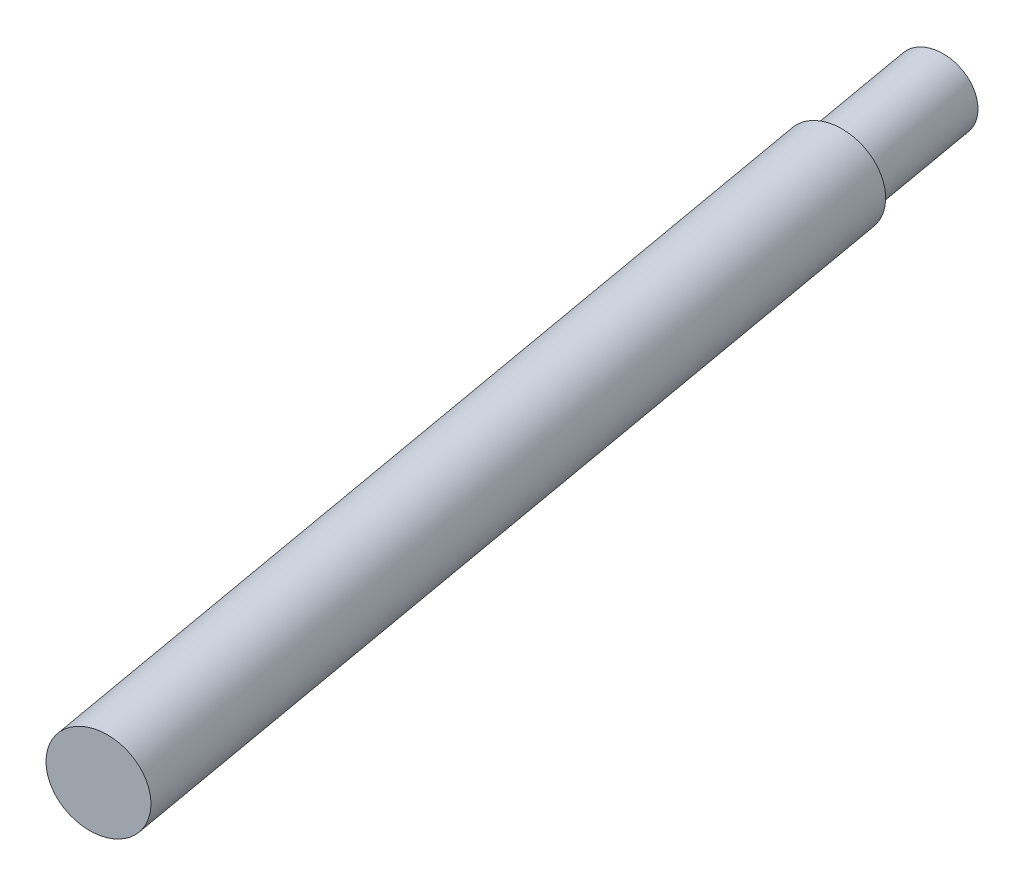
ISO-10303-21;
HEADER;
FILE_DESCRIPTION(('STEP AP214'),'2;1');
FILE_NAME('part.step','',(''),(''),'','','');
FILE_SCHEMA(('AUTOMOTIVE_DESIGN { 1 0 10303 214 1 1 1 1 }'));
ENDSEC;
DATA;
#1=APPLICATION_CONTEXT('core data for automotive mechanical design processes');
#2=APPLICATION_PROTOCOL_DEFINITION('international standard','automotive_design',2000,#1);
#3=PRODUCT_CONTEXT('',#1,'mechanical');
#4=PRODUCT('Part','Part','',(#3));
#5=PRODUCT_RELATED_PRODUCT_CATEGORY('part','',(#4));
#6=PRODUCT_DEFINITION_FORMATION('','',#4);
#7=PRODUCT_DEFINITION_CONTEXT('part definition',#1,'design');
#8=PRODUCT_DEFINITION('design','',#6,#7);
#9=PRODUCT_DEFINITION_SHAPE('','',#8);
#10=(LENGTH_UNIT() NAMED_UNIT(*) SI_UNIT(.MILLI.,.METRE.));
#11=(NAMED_UNIT(*) PLANE_ANGLE_UNIT() SI_UNIT($,.RADIAN.));
#12=(NAMED_UNIT(*) SI_UNIT($,.STERADIAN.) SOLID_ANGLE_UNIT());
#13=UNCERTAINTY_MEASURE_WITH_UNIT(LENGTH_MEASURE(1.E-05),#10,'distance_accuracy_value','');
#14=(GEOMETRIC_REPRESENTATION_CONTEXT(3) GLOBAL_UNCERTAINTY_ASSIGNED_CONTEXT((#13)) GLOBAL_UNIT_ASSIGNED_CONTEXT((#10,
#11,#12)) REPRESENTATION_CONTEXT('',''));
#15=CARTESIAN_POINT('',(0.,0.,0.));
#16=DIRECTION('',(0.,0.,1.));
#17=DIRECTION('',(1.,0.,0.));
#18=AXIS2_PLACEMENT_3D('',#15,#16,#17);
#19=CARTESIAN_POINT('',(11.67225708508,118.9917103573,7.637451840213));
#20=DIRECTION('',(0.17364817766695,0.,0.984807753012204));
#21=DIRECTION('',(-0.0479137499271273,0.998815746590787,0.00844848685917072));
#22=AXIS2_PLACEMENT_3D('',#19,#20,#21);
#23=PLANE('',#22);
#24=CARTESIAN_POINT('',(6.30818153894857,123.9325577555,8.58328308554958));
#25=DIRECTION('',(-0.173648177670289,0.,-0.984807753011616));
#26=DIRECTION('',(-0.984807753011616,0.,0.173648177670289));
#27=AXIS2_PLACEMENT_3D('',#24,#25,#26);
#28=CIRCLE('',#27,5.00000000005461);
#29=CARTESIAN_POINT('',(1.38414277383671,123.9325577555,9.45152397391051));
#30=VERTEX_POINT('',#29);
#31=EDGE_CURVE('E19',#30,#30,#28,.F.);
#32=ORIENTED_EDGE('',*,*,#31,.T.);
#33=EDGE_LOOP('',(#32));
#34=FACE_BOUND('',#33,.T.);
#35=ADVANCED_FACE('F15',(#34),#23,.T.);
#36=CARTESIAN_POINT('',(-17.38842302427,119.5746883034,-102.9969999337));
#37=DIRECTION('',(-0.173648177674628,-8.300870407707E-12,-0.984807753010851));
#38=DIRECTION('',(-0.0479137499263157,0.998815746590896,0.00844848685089488));
#39=AXIS2_PLACEMENT_3D('',#36,#37,#38);
#40=PLANE('',#39);
#41=CARTESIAN_POINT('',(-13.4877107153062,123.9325577555,-103.684800757812));
#42=DIRECTION('',(0.173648177658873,0.,0.984807753013629));
#43=DIRECTION('',(0.984807753013629,0.,-0.173648177658873));
#44=AXIS2_PLACEMENT_3D('',#41,#42,#43);
#45=CIRCLE('',#44,4.00000000003963);
#46=CARTESIAN_POINT('',(-9.54847970321262,123.9325577555,-104.379393468454));
#47=VERTEX_POINT('',#46);
#48=EDGE_CURVE('E28',#47,#47,#45,.F.);
#49=ORIENTED_EDGE('',*,*,#48,.T.);
#50=EDGE_LOOP('',(#49));
#51=FACE_BOUND('',#50,.T.);
#52=ADVANCED_FACE('F40',(#51),#40,.T.);
#53=CARTESIAN_POINT('',(6.30818153894858,123.9325577555,8.58328308554964));
#54=DIRECTION('',(-0.173648177670289,0.,-0.984807753011616));
#55=DIRECTION('',(-0.984807753011616,0.,0.173648177670289));
#56=AXIS2_PLACEMENT_3D('',#53,#54,#55);
#57=CYLINDRICAL_SURFACE('',#56,5.00000000005461);
#58=CARTESIAN_POINT('',(-11.0566362280798,123.9325577555,-89.8974922156088));
#59=DIRECTION('',(-0.173648177670289,0.,-0.984807753011616));
#60=DIRECTION('',(-0.984807753011616,0.,0.173648177670289));
#61=AXIS2_PLACEMENT_3D('',#58,#59,#60);
#62=CIRCLE('',#61,5.00000000005461);
#63=CARTESIAN_POINT('',(-15.9806749931916,123.9325577555,-89.0292513272478));
#64=VERTEX_POINT('',#63);
#65=EDGE_CURVE('E23',#64,#64,#62,.F.);
#66=ORIENTED_EDGE('',*,*,#65,.T.);
#67=EDGE_LOOP('',(#66));
#68=FACE_BOUND('',#67,.T.);
#69=ORIENTED_EDGE('',*,*,#31,.F.);
#70=EDGE_LOOP('',(#69));
#71=FACE_BOUND('',#70,.T.);
#72=ADVANCED_FACE('F37',(#68,#71),#57,.T.);
#73=CARTESIAN_POINT('',(-13.4877107153062,123.9325577555,-103.684800757812));
#74=DIRECTION('',(0.173648177658873,0.,0.984807753013629));
#75=DIRECTION('',(0.984807753013629,0.,-0.173648177658873));
#76=AXIS2_PLACEMENT_3D('',#73,#74,#75);
#77=CYLINDRICAL_SURFACE('',#76,4.00000000003963);
#78=CARTESIAN_POINT('',(-11.0566362280797,123.9325577555,-89.8974922156086));
#79=DIRECTION('',(0.173648177658873,0.,0.984807753013629));
#80=DIRECTION('',(0.984807753013629,0.,-0.173648177658873));
#81=AXIS2_PLACEMENT_3D('',#78,#79,#80);
#82=CIRCLE('',#81,4.00000000003963);
#83=CARTESIAN_POINT('',(-7.11740521598619,123.9325577555,-90.5920849262509));
#84=VERTEX_POINT('',#83);
#85=EDGE_CURVE('E10',#84,#84,#82,.F.);
#86=ORIENTED_EDGE('',*,*,#85,.T.);
#87=EDGE_LOOP('',(#86));
#88=FACE_BOUND('',#87,.T.);
#89=ORIENTED_EDGE('',*,*,#48,.F.);
#90=EDGE_LOOP('',(#89));
#91=FACE_BOUND('',#90,.T.);
#92=ADVANCED_FACE('F39',(#88,#91),#77,.T.);
#93=CARTESIAN_POINT('',(-5.692560681613,118.9917103573,-90.84332346101));
#94=DIRECTION('',(0.173648177667157,-5.23463217216857E-13,0.984807753012168));
#95=DIRECTION('',(-0.0479137499273187,0.998815746590774,0.00844848685964682));
#96=AXIS2_PLACEMENT_3D('',#93,#94,#95);
#97=PLANE('',#96);
#98=ORIENTED_EDGE('',*,*,#85,.F.);
#99=EDGE_LOOP('',(#98));
#100=FACE_BOUND('',#99,.T.);
#101=ORIENTED_EDGE('',*,*,#65,.F.);
#102=EDGE_LOOP('',(#101));
#103=FACE_BOUND('',#102,.T.);
#104=ADVANCED_FACE('F17',(#100,#103),#97,.F.);
#105=CLOSED_SHELL('',(#35,#52,#72,#92,#104));
#106=MANIFOLD_SOLID_BREP('B1',#105);
#107=ADVANCED_BREP_SHAPE_REPRESENTATION('',(#18,#106),#14);
#108=SHAPE_DEFINITION_REPRESENTATION(#9,#107);
ENDSEC;
END-ISO-10303-21;
